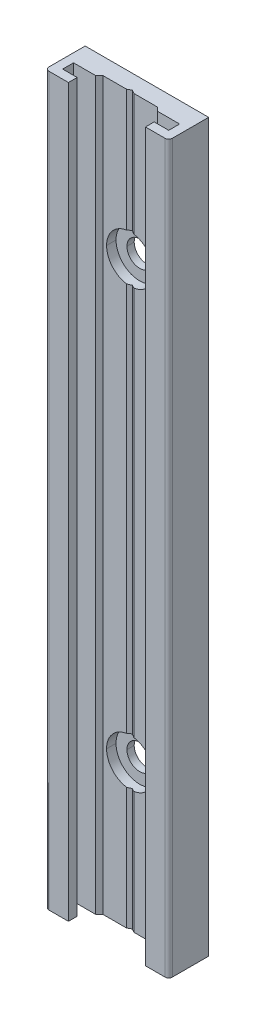
ISO-10303-21;
HEADER;
FILE_DESCRIPTION(('STEP AP214'),'2;1');
FILE_NAME('part.step','',(''),(''),'','','');
FILE_SCHEMA(('AUTOMOTIVE_DESIGN { 1 0 10303 214 1 1 1 1 }'));
ENDSEC;
DATA;
#1=APPLICATION_CONTEXT('core data for automotive mechanical design processes');
#2=APPLICATION_PROTOCOL_DEFINITION('international standard','automotive_design',2000,#1);
#3=PRODUCT_CONTEXT('',#1,'mechanical');
#4=PRODUCT('Part','Part','',(#3));
#5=PRODUCT_RELATED_PRODUCT_CATEGORY('part','',(#4));
#6=PRODUCT_DEFINITION_FORMATION('','',#4);
#7=PRODUCT_DEFINITION_CONTEXT('part definition',#1,'design');
#8=PRODUCT_DEFINITION('design','',#6,#7);
#9=PRODUCT_DEFINITION_SHAPE('','',#8);
#10=(LENGTH_UNIT() NAMED_UNIT(*) SI_UNIT(.MILLI.,.METRE.));
#11=(NAMED_UNIT(*) PLANE_ANGLE_UNIT() SI_UNIT($,.RADIAN.));
#12=(NAMED_UNIT(*) SI_UNIT($,.STERADIAN.) SOLID_ANGLE_UNIT());
#13=UNCERTAINTY_MEASURE_WITH_UNIT(LENGTH_MEASURE(1.E-05),#10,'distance_accuracy_value','');
#14=(GEOMETRIC_REPRESENTATION_CONTEXT(3) GLOBAL_UNCERTAINTY_ASSIGNED_CONTEXT((#13)) GLOBAL_UNIT_ASSIGNED_CONTEXT((#10,
#11,#12)) REPRESENTATION_CONTEXT('',''));
#15=CARTESIAN_POINT('',(0.,0.,0.));
#16=DIRECTION('',(0.,0.,1.));
#17=DIRECTION('',(1.,0.,0.));
#18=AXIS2_PLACEMENT_3D('',#15,#16,#17);
#19=CARTESIAN_POINT('',(5.3,0.,5.5));
#20=DIRECTION('',(-1.,0.,0.));
#21=DIRECTION('',(0.,0.,1.));
#22=AXIS2_PLACEMENT_3D('',#19,#20,#21);
#23=PLANE('',#22);
#24=DIRECTION('',(0.,0.,1.));
#25=VECTOR('',#24,1.);
#26=CARTESIAN_POINT('',(5.3,0.,5.5));
#27=LINE('',#26,#25);
#28=CARTESIAN_POINT('',(5.3,0.,4.3));
#29=VERTEX_POINT('',#28);
#30=CARTESIAN_POINT('',(5.3,0.,5.5));
#31=VERTEX_POINT('',#30);
#32=EDGE_CURVE('E310',#29,#31,#27,.T.);
#33=ORIENTED_EDGE('',*,*,#32,.T.);
#34=DIRECTION('',(0.,1.,0.));
#35=VECTOR('',#34,1.);
#36=CARTESIAN_POINT('',(5.3,0.,5.5));
#37=LINE('',#36,#35);
#38=CARTESIAN_POINT('',(5.3,100.,5.5));
#39=VERTEX_POINT('',#38);
#40=EDGE_CURVE('E236',#39,#31,#37,.F.);
#41=ORIENTED_EDGE('',*,*,#40,.F.);
#42=DIRECTION('',(0.,0.,1.));
#43=VECTOR('',#42,1.);
#44=CARTESIAN_POINT('',(5.3,100.,5.5));
#45=LINE('',#44,#43);
#46=CARTESIAN_POINT('',(5.3,100.,4.3));
#47=VERTEX_POINT('',#46);
#48=EDGE_CURVE('E311',#39,#47,#45,.F.);
#49=ORIENTED_EDGE('',*,*,#48,.T.);
#50=DIRECTION('',(0.,1.,0.));
#51=VECTOR('',#50,1.);
#52=CARTESIAN_POINT('',(5.3,0.,4.3));
#53=LINE('',#52,#51);
#54=EDGE_CURVE('E339',#29,#47,#53,.T.);
#55=ORIENTED_EDGE('',*,*,#54,.F.);
#56=EDGE_LOOP('',(#33,#41,#49,#55));
#57=FACE_BOUND('',#56,.T.);
#58=ADVANCED_FACE('F15',(#57),#23,.T.);
#59=CARTESIAN_POINT('',(7.3,0.,4.3));
#60=DIRECTION('',(-1.,0.,0.));
#61=DIRECTION('',(0.,0.,1.));
#62=AXIS2_PLACEMENT_3D('',#59,#60,#61);
#63=PLANE('',#62);
#64=DIRECTION('',(0.,0.,1.));
#65=VECTOR('',#64,1.);
#66=CARTESIAN_POINT('',(7.3,0.,4.3));
#67=LINE('',#66,#65);
#68=CARTESIAN_POINT('',(7.3,0.,2.8));
#69=VERTEX_POINT('',#68);
#70=CARTESIAN_POINT('',(7.3,0.,4.3));
#71=VERTEX_POINT('',#70);
#72=EDGE_CURVE('E294',#69,#71,#67,.T.);
#73=ORIENTED_EDGE('',*,*,#72,.T.);
#74=DIRECTION('',(0.,1.,0.));
#75=VECTOR('',#74,1.);
#76=CARTESIAN_POINT('',(7.3,0.,4.3));
#77=LINE('',#76,#75);
#78=CARTESIAN_POINT('',(7.3,100.,4.3));
#79=VERTEX_POINT('',#78);
#80=EDGE_CURVE('E343',#79,#71,#77,.F.);
#81=ORIENTED_EDGE('',*,*,#80,.F.);
#82=DIRECTION('',(0.,0.,1.));
#83=VECTOR('',#82,1.);
#84=CARTESIAN_POINT('',(7.3,100.,4.3));
#85=LINE('',#84,#83);
#86=CARTESIAN_POINT('',(7.3,100.,2.8));
#87=VERTEX_POINT('',#86);
#88=EDGE_CURVE('E307',#79,#87,#85,.F.);
#89=ORIENTED_EDGE('',*,*,#88,.T.);
#90=DIRECTION('',(0.,1.,0.));
#91=VECTOR('',#90,1.);
#92=CARTESIAN_POINT('',(7.3,0.,2.8));
#93=LINE('',#92,#91);
#94=EDGE_CURVE('E229',#69,#87,#93,.T.);
#95=ORIENTED_EDGE('',*,*,#94,.F.);
#96=EDGE_LOOP('',(#73,#81,#89,#95));
#97=FACE_BOUND('',#96,.T.);
#98=ADVANCED_FACE('F751',(#97),#63,.T.);
#99=CARTESIAN_POINT('',(0.5,0.,2.3));
#100=DIRECTION('',(-0.499999994031163,0.,0.866025407230548));
#101=DIRECTION('',(0.866025407230548,0.,0.499999994031163));
#102=AXIS2_PLACEMENT_3D('',#99,#100,#101);
#103=PLANE('',#102);
#104=CARTESIAN_POINT('',(0.,20.,2.01132487));
#105=DIRECTION('',(-0.499999994031163,0.,0.866025407230548));
#106=DIRECTION('',(-0.866025407230548,0.,-0.499999994031163));
#107=AXIS2_PLACEMENT_3D('',#104,#105,#106);
#108=ELLIPSE('',#107,3.75277673479943,3.25);
#109=CARTESIAN_POINT('',(0.,23.25,2.01132487));
#110=VERTEX_POINT('',#109);
#111=CARTESIAN_POINT('',(0.5,23.2113081446663,2.3));
#112=VERTEX_POINT('',#111);
#113=EDGE_CURVE('E217',#110,#112,#108,.F.);
#114=ORIENTED_EDGE('',*,*,#113,.T.);
#115=DIRECTION('',(0.,1.,0.));
#116=VECTOR('',#115,1.);
#117=CARTESIAN_POINT('',(0.5,0.,2.3));
#118=LINE('',#117,#116);
#119=CARTESIAN_POINT('',(0.5,76.7886918553337,2.3));
#120=VERTEX_POINT('',#119);
#121=EDGE_CURVE('E215',#120,#112,#118,.F.);
#122=ORIENTED_EDGE('',*,*,#121,.F.);
#123=CARTESIAN_POINT('',(0.,80.,2.01132487));
#124=DIRECTION('',(-0.499999994031163,0.,0.866025407230548));
#125=DIRECTION('',(-0.866025407230548,0.,-0.499999994031163));
#126=AXIS2_PLACEMENT_3D('',#123,#124,#125);
#127=ELLIPSE('',#126,3.75277673479943,3.25);
#128=CARTESIAN_POINT('',(0.,76.75,2.01132487));
#129=VERTEX_POINT('',#128);
#130=EDGE_CURVE('E18',#120,#129,#127,.F.);
#131=ORIENTED_EDGE('',*,*,#130,.T.);
#132=DIRECTION('',(0.,1.,0.));
#133=VECTOR('',#132,1.);
#134=CARTESIAN_POINT('',(0.,0.,2.01132487));
#135=LINE('',#134,#133);
#136=EDGE_CURVE('E251',#110,#129,#135,.T.);
#137=ORIENTED_EDGE('',*,*,#136,.F.);
#138=EDGE_LOOP('',(#114,#122,#131,#137));
#139=FACE_BOUND('',#138,.T.);
#140=ADVANCED_FACE('F216',(#139),#103,.T.);
#141=CARTESIAN_POINT('',(0.5,0.,2.3));
#142=DIRECTION('',(-0.499999994031163,0.,0.866025407230548));
#143=DIRECTION('',(0.866025407230548,0.,0.499999994031163));
#144=AXIS2_PLACEMENT_3D('',#141,#142,#143);
#145=PLANE('',#144);
#146=DIRECTION('',(0.866025407230548,0.,0.499999994031163));
#147=VECTOR('',#146,1.);
#148=CARTESIAN_POINT('',(0.5,0.,2.3));
#149=LINE('',#148,#147);
#150=CARTESIAN_POINT('',(0.,0.,2.01132487));
#151=VERTEX_POINT('',#150);
#152=CARTESIAN_POINT('',(0.5,0.,2.3));
#153=VERTEX_POINT('',#152);
#154=EDGE_CURVE('E292',#151,#153,#149,.T.);
#155=ORIENTED_EDGE('',*,*,#154,.T.);
#156=DIRECTION('',(0.,1.,0.));
#157=VECTOR('',#156,1.);
#158=CARTESIAN_POINT('',(0.5,0.,2.3));
#159=LINE('',#158,#157);
#160=CARTESIAN_POINT('',(0.5,16.7886918553337,2.3));
#161=VERTEX_POINT('',#160);
#162=EDGE_CURVE('E410',#161,#153,#159,.F.);
#163=ORIENTED_EDGE('',*,*,#162,.F.);
#164=CARTESIAN_POINT('',(0.,20.,2.01132487));
#165=DIRECTION('',(-0.499999994031163,0.,0.866025407230548));
#166=DIRECTION('',(-0.866025407230548,0.,-0.499999994031163));
#167=AXIS2_PLACEMENT_3D('',#164,#165,#166);
#168=ELLIPSE('',#167,3.75277673479943,3.25);
#169=CARTESIAN_POINT('',(0.,16.75,2.01132487));
#170=VERTEX_POINT('',#169);
#171=EDGE_CURVE('E258',#161,#170,#168,.F.);
#172=ORIENTED_EDGE('',*,*,#171,.T.);
#173=DIRECTION('',(0.,1.,0.));
#174=VECTOR('',#173,1.);
#175=CARTESIAN_POINT('',(0.,0.,2.01132487));
#176=LINE('',#175,#174);
#177=EDGE_CURVE('E260',#151,#170,#176,.T.);
#178=ORIENTED_EDGE('',*,*,#177,.F.);
#179=EDGE_LOOP('',(#155,#163,#172,#178));
#180=FACE_BOUND('',#179,.T.);
#181=ADVANCED_FACE('F428',(#180),#145,.T.);
#182=CARTESIAN_POINT('',(4.25,0.,2.8));
#183=DIRECTION('',(-0.707106781186548,0.,0.707106781186548));
#184=DIRECTION('',(0.707106781186548,0.,0.707106781186548));
#185=AXIS2_PLACEMENT_3D('',#182,#183,#184);
#186=PLANE('',#185);
#187=DIRECTION('',(0.707106781186548,0.,0.707106781186548));
#188=VECTOR('',#187,1.);
#189=CARTESIAN_POINT('',(4.25,0.,2.8));
#190=LINE('',#189,#188);
#191=CARTESIAN_POINT('',(3.75,0.,2.3));
#192=VERTEX_POINT('',#191);
#193=CARTESIAN_POINT('',(4.25,0.,2.8));
#194=VERTEX_POINT('',#193);
#195=EDGE_CURVE('E278',#192,#194,#190,.T.);
#196=ORIENTED_EDGE('',*,*,#195,.T.);
#197=DIRECTION('',(0.,1.,0.));
#198=VECTOR('',#197,1.);
#199=CARTESIAN_POINT('',(4.25,0.,2.8));
#200=LINE('',#199,#198);
#201=CARTESIAN_POINT('',(4.25,100.,2.8));
#202=VERTEX_POINT('',#201);
#203=EDGE_CURVE('E342',#202,#194,#200,.F.);
#204=ORIENTED_EDGE('',*,*,#203,.F.);
#205=DIRECTION('',(0.707106781186548,0.,0.707106781186548));
#206=VECTOR('',#205,1.);
#207=CARTESIAN_POINT('',(4.25,100.,2.8));
#208=LINE('',#207,#206);
#209=CARTESIAN_POINT('',(3.75,100.,2.3));
#210=VERTEX_POINT('',#209);
#211=EDGE_CURVE('E289',#202,#210,#208,.F.);
#212=ORIENTED_EDGE('',*,*,#211,.T.);
#213=DIRECTION('',(0.,1.,0.));
#214=VECTOR('',#213,1.);
#215=CARTESIAN_POINT('',(3.75,0.,2.3));
#216=LINE('',#215,#214);
#217=EDGE_CURVE('E413',#192,#210,#216,.T.);
#218=ORIENTED_EDGE('',*,*,#217,.F.);
#219=EDGE_LOOP('',(#196,#204,#212,#218));
#220=FACE_BOUND('',#219,.T.);
#221=ADVANCED_FACE('F442',(#220),#186,.T.);
#222=CARTESIAN_POINT('',(0.5,0.,2.3));
#223=DIRECTION('',(-0.499999994031163,0.,0.866025407230548));
#224=DIRECTION('',(0.866025407230548,0.,0.499999994031163));
#225=AXIS2_PLACEMENT_3D('',#222,#223,#224);
#226=PLANE('',#225);
#227=DIRECTION('',(0.866025407230548,0.,0.499999994031163));
#228=VECTOR('',#227,1.);
#229=CARTESIAN_POINT('',(0.5,100.,2.3));
#230=LINE('',#229,#228);
#231=CARTESIAN_POINT('',(0.5,100.,2.3));
#232=VERTEX_POINT('',#231);
#233=CARTESIAN_POINT('',(0.,100.,2.01132487));
#234=VERTEX_POINT('',#233);
#235=EDGE_CURVE('E213',#232,#234,#230,.F.);
#236=ORIENTED_EDGE('',*,*,#235,.T.);
#237=DIRECTION('',(0.,1.,0.));
#238=VECTOR('',#237,1.);
#239=CARTESIAN_POINT('',(0.,0.,2.01132487));
#240=LINE('',#239,#238);
#241=CARTESIAN_POINT('',(0.,83.25,2.01132487));
#242=VERTEX_POINT('',#241);
#243=EDGE_CURVE('E263',#242,#234,#240,.T.);
#244=ORIENTED_EDGE('',*,*,#243,.F.);
#245=CARTESIAN_POINT('',(0.,80.,2.01132487));
#246=DIRECTION('',(-0.499999994031163,0.,0.866025407230548));
#247=DIRECTION('',(-0.866025407230548,0.,-0.499999994031163));
#248=AXIS2_PLACEMENT_3D('',#245,#246,#247);
#249=ELLIPSE('',#248,3.75277673479943,3.25);
#250=CARTESIAN_POINT('',(0.5,83.2113081446663,2.3));
#251=VERTEX_POINT('',#250);
#252=EDGE_CURVE('E265',#242,#251,#249,.F.);
#253=ORIENTED_EDGE('',*,*,#252,.T.);
#254=DIRECTION('',(0.,1.,0.));
#255=VECTOR('',#254,1.);
#256=CARTESIAN_POINT('',(0.5,0.,2.3));
#257=LINE('',#256,#255);
#258=EDGE_CURVE('E407',#232,#251,#257,.F.);
#259=ORIENTED_EDGE('',*,*,#258,.F.);
#260=EDGE_LOOP('',(#236,#244,#253,#259));
#261=FACE_BOUND('',#260,.T.);
#262=ADVANCED_FACE('F766',(#261),#226,.T.);
#263=CARTESIAN_POINT('',(0.,80.,1.65));
#264=DIRECTION('',(0.,0.,-1.));
#265=DIRECTION('',(-1.,0.,0.));
#266=AXIS2_PLACEMENT_3D('',#263,#264,#265);
#267=CYLINDRICAL_SURFACE('',#266,3.25);
#268=CARTESIAN_POINT('',(0.,80.,1.));
#269=DIRECTION('',(0.,0.,-1.));
#270=DIRECTION('',(-1.,0.,0.));
#271=AXIS2_PLACEMENT_3D('',#268,#269,#270);
#272=CIRCLE('',#271,3.25);
#273=CARTESIAN_POINT('',(3.25,80.,1.));
#274=VERTEX_POINT('',#273);
#275=CARTESIAN_POINT('',(-3.25,80.,1.));
#276=VERTEX_POINT('',#275);
#277=EDGE_CURVE('E245',#274,#276,#272,.T.);
#278=ORIENTED_EDGE('',*,*,#277,.T.);
#279=DIRECTION('',(0.,0.,-1.));
#280=VECTOR('',#279,1.);
#281=CARTESIAN_POINT('',(-3.25,80.,1.65));
#282=LINE('',#281,#280);
#283=CARTESIAN_POINT('',(-3.25,80.,2.3));
#284=VERTEX_POINT('',#283);
#285=EDGE_CURVE('E212',#276,#284,#282,.F.);
#286=ORIENTED_EDGE('',*,*,#285,.T.);
#287=CARTESIAN_POINT('',(0.,80.,2.3));
#288=DIRECTION('',(0.,0.,-1.));
#289=DIRECTION('',(-1.,0.,0.));
#290=AXIS2_PLACEMENT_3D('',#287,#288,#289);
#291=CIRCLE('',#290,3.25);
#292=CARTESIAN_POINT('',(-0.5,76.7886918553337,2.3));
#293=VERTEX_POINT('',#292);
#294=EDGE_CURVE('E405',#293,#284,#291,.T.);
#295=ORIENTED_EDGE('',*,*,#294,.F.);
#296=CARTESIAN_POINT('',(0.,80.,2.01132487));
#297=DIRECTION('',(0.499999994031163,0.,0.866025407230548));
#298=DIRECTION('',(0.866025407230548,0.,-0.499999994031163));
#299=AXIS2_PLACEMENT_3D('',#296,#297,#298);
#300=ELLIPSE('',#299,3.75277673479943,3.25);
#301=EDGE_CURVE('E208',#129,#293,#300,.F.);
#302=ORIENTED_EDGE('',*,*,#301,.F.);
#303=ORIENTED_EDGE('',*,*,#130,.F.);
#304=CARTESIAN_POINT('',(0.,80.,2.3));
#305=DIRECTION('',(0.,0.,-1.));
#306=DIRECTION('',(-1.,0.,0.));
#307=AXIS2_PLACEMENT_3D('',#304,#305,#306);
#308=CIRCLE('',#307,3.25);
#309=CARTESIAN_POINT('',(3.25,80.,2.3));
#310=VERTEX_POINT('',#309);
#311=EDGE_CURVE('E205',#310,#120,#308,.T.);
#312=ORIENTED_EDGE('',*,*,#311,.F.);
#313=DIRECTION('',(0.,0.,-1.));
#314=VECTOR('',#313,1.);
#315=CARTESIAN_POINT('',(3.25,80.,1.65));
#316=LINE('',#315,#314);
#317=EDGE_CURVE('E264',#310,#274,#316,.T.);
#318=ORIENTED_EDGE('',*,*,#317,.T.);
#319=EDGE_LOOP('',(#278,#286,#295,#302,#303,#312,#318));
#320=FACE_BOUND('',#319,.T.);
#321=ADVANCED_FACE('F203',(#320),#267,.F.);
#322=CARTESIAN_POINT('',(0.,80.,1.65));
#323=DIRECTION('',(0.,0.,-1.));
#324=DIRECTION('',(-1.,0.,0.));
#325=AXIS2_PLACEMENT_3D('',#322,#323,#324);
#326=CYLINDRICAL_SURFACE('',#325,3.25);
#327=CARTESIAN_POINT('',(0.,80.,2.3));
#328=DIRECTION('',(0.,0.,-1.));
#329=DIRECTION('',(-1.,0.,0.));
#330=AXIS2_PLACEMENT_3D('',#327,#328,#329);
#331=CIRCLE('',#330,3.25);
#332=EDGE_CURVE('E227',#251,#310,#331,.T.);
#333=ORIENTED_EDGE('',*,*,#332,.F.);
#334=ORIENTED_EDGE('',*,*,#252,.F.);
#335=CARTESIAN_POINT('',(0.,80.,2.01132487));
#336=DIRECTION('',(0.499999994031163,0.,0.866025407230548));
#337=DIRECTION('',(0.866025407230548,0.,-0.499999994031163));
#338=AXIS2_PLACEMENT_3D('',#335,#336,#337);
#339=ELLIPSE('',#338,3.75277673479943,3.25);
#340=CARTESIAN_POINT('',(-0.5,83.2113081446663,2.3));
#341=VERTEX_POINT('',#340);
#342=EDGE_CURVE('E261',#341,#242,#339,.F.);
#343=ORIENTED_EDGE('',*,*,#342,.F.);
#344=CARTESIAN_POINT('',(0.,80.,2.3));
#345=DIRECTION('',(0.,0.,-1.));
#346=DIRECTION('',(-1.,0.,0.));
#347=AXIS2_PLACEMENT_3D('',#344,#345,#346);
#348=CIRCLE('',#347,3.25);
#349=EDGE_CURVE('E401',#284,#341,#348,.T.);
#350=ORIENTED_EDGE('',*,*,#349,.F.);
#351=ORIENTED_EDGE('',*,*,#285,.F.);
#352=CARTESIAN_POINT('',(0.,80.,1.));
#353=DIRECTION('',(0.,0.,-1.));
#354=DIRECTION('',(-1.,0.,0.));
#355=AXIS2_PLACEMENT_3D('',#352,#353,#354);
#356=CIRCLE('',#355,3.25);
#357=EDGE_CURVE('E242',#276,#274,#356,.T.);
#358=ORIENTED_EDGE('',*,*,#357,.T.);
#359=ORIENTED_EDGE('',*,*,#317,.F.);
#360=EDGE_LOOP('',(#333,#334,#343,#350,#351,#358,#359));
#361=FACE_BOUND('',#360,.T.);
#362=ADVANCED_FACE('F769',(#361),#326,.F.);
#363=CARTESIAN_POINT('',(0.,0.,2.01132487));
#364=DIRECTION('',(0.499999994031163,0.,0.866025407230548));
#365=DIRECTION('',(0.866025407230548,0.,-0.499999994031163));
#366=AXIS2_PLACEMENT_3D('',#363,#364,#365);
#367=PLANE('',#366);
#368=DIRECTION('',(0.866025407230548,0.,-0.499999994031163));
#369=VECTOR('',#368,1.);
#370=CARTESIAN_POINT('',(0.,100.,2.01132487));
#371=LINE('',#370,#369);
#372=CARTESIAN_POINT('',(-0.5,100.,2.3));
#373=VERTEX_POINT('',#372);
#374=EDGE_CURVE('E504',#234,#373,#371,.F.);
#375=ORIENTED_EDGE('',*,*,#374,.T.);
#376=DIRECTION('',(0.,1.,0.));
#377=VECTOR('',#376,1.);
#378=CARTESIAN_POINT('',(-0.5,0.,2.3));
#379=LINE('',#378,#377);
#380=EDGE_CURVE('E404',#341,#373,#379,.T.);
#381=ORIENTED_EDGE('',*,*,#380,.F.);
#382=ORIENTED_EDGE('',*,*,#342,.T.);
#383=ORIENTED_EDGE('',*,*,#243,.T.);
#384=EDGE_LOOP('',(#375,#381,#382,#383));
#385=FACE_BOUND('',#384,.T.);
#386=ADVANCED_FACE('F767',(#385),#367,.T.);
#387=CARTESIAN_POINT('',(0.,0.,2.01132487));
#388=DIRECTION('',(0.499999994031163,0.,0.866025407230548));
#389=DIRECTION('',(0.866025407230548,0.,-0.499999994031163));
#390=AXIS2_PLACEMENT_3D('',#387,#388,#389);
#391=PLANE('',#390);
#392=DIRECTION('',(0.866025407230548,0.,-0.499999994031163));
#393=VECTOR('',#392,1.);
#394=CARTESIAN_POINT('',(0.,0.,2.01132487));
#395=LINE('',#394,#393);
#396=CARTESIAN_POINT('',(-0.5,0.,2.3));
#397=VERTEX_POINT('',#396);
#398=EDGE_CURVE('E499',#397,#151,#395,.T.);
#399=ORIENTED_EDGE('',*,*,#398,.T.);
#400=ORIENTED_EDGE('',*,*,#177,.T.);
#401=CARTESIAN_POINT('',(0.,20.,2.01132487));
#402=DIRECTION('',(0.499999994031163,0.,0.866025407230548));
#403=DIRECTION('',(0.866025407230548,0.,-0.499999994031163));
#404=AXIS2_PLACEMENT_3D('',#401,#402,#403);
#405=ELLIPSE('',#404,3.75277673479943,3.25);
#406=CARTESIAN_POINT('',(-0.5,16.7886918553337,2.3));
#407=VERTEX_POINT('',#406);
#408=EDGE_CURVE('E256',#170,#407,#405,.F.);
#409=ORIENTED_EDGE('',*,*,#408,.T.);
#410=DIRECTION('',(0.,1.,0.));
#411=VECTOR('',#410,1.);
#412=CARTESIAN_POINT('',(-0.5,0.,2.3));
#413=LINE('',#412,#411);
#414=EDGE_CURVE('E400',#397,#407,#413,.T.);
#415=ORIENTED_EDGE('',*,*,#414,.F.);
#416=EDGE_LOOP('',(#399,#400,#409,#415));
#417=FACE_BOUND('',#416,.T.);
#418=ADVANCED_FACE('F608',(#417),#391,.T.);
#419=CARTESIAN_POINT('',(0.,20.,1.65));
#420=DIRECTION('',(0.,0.,-1.));
#421=DIRECTION('',(-1.,0.,0.));
#422=AXIS2_PLACEMENT_3D('',#419,#420,#421);
#423=CYLINDRICAL_SURFACE('',#422,3.25);
#424=CARTESIAN_POINT('',(0.,20.,1.));
#425=DIRECTION('',(0.,0.,-1.));
#426=DIRECTION('',(-1.,0.,0.));
#427=AXIS2_PLACEMENT_3D('',#424,#425,#426);
#428=CIRCLE('',#427,3.25);
#429=CARTESIAN_POINT('',(3.25,20.,1.));
#430=VERTEX_POINT('',#429);
#431=CARTESIAN_POINT('',(-3.25,20.,1.));
#432=VERTEX_POINT('',#431);
#433=EDGE_CURVE('E240',#430,#432,#428,.T.);
#434=ORIENTED_EDGE('',*,*,#433,.T.);
#435=DIRECTION('',(0.,0.,-1.));
#436=VECTOR('',#435,1.);
#437=CARTESIAN_POINT('',(-3.25,20.,1.65));
#438=LINE('',#437,#436);
#439=CARTESIAN_POINT('',(-3.25,20.,2.3));
#440=VERTEX_POINT('',#439);
#441=EDGE_CURVE('E255',#432,#440,#438,.F.);
#442=ORIENTED_EDGE('',*,*,#441,.T.);
#443=CARTESIAN_POINT('',(0.,20.,2.3));
#444=DIRECTION('',(0.,0.,-1.));
#445=DIRECTION('',(-1.,0.,0.));
#446=AXIS2_PLACEMENT_3D('',#443,#444,#445);
#447=CIRCLE('',#446,3.25);
#448=EDGE_CURVE('E397',#407,#440,#447,.T.);
#449=ORIENTED_EDGE('',*,*,#448,.F.);
#450=ORIENTED_EDGE('',*,*,#408,.F.);
#451=ORIENTED_EDGE('',*,*,#171,.F.);
#452=CARTESIAN_POINT('',(0.,20.,2.3));
#453=DIRECTION('',(0.,0.,-1.));
#454=DIRECTION('',(-1.,0.,0.));
#455=AXIS2_PLACEMENT_3D('',#452,#453,#454);
#456=CIRCLE('',#455,3.25);
#457=CARTESIAN_POINT('',(3.25,20.,2.3));
#458=VERTEX_POINT('',#457);
#459=EDGE_CURVE('E408',#458,#161,#456,.T.);
#460=ORIENTED_EDGE('',*,*,#459,.F.);
#461=DIRECTION('',(0.,0.,-1.));
#462=VECTOR('',#461,1.);
#463=CARTESIAN_POINT('',(3.25,20.,1.65));
#464=LINE('',#463,#462);
#465=EDGE_CURVE('E253',#458,#430,#464,.T.);
#466=ORIENTED_EDGE('',*,*,#465,.T.);
#467=EDGE_LOOP('',(#434,#442,#449,#450,#451,#460,#466));
#468=FACE_BOUND('',#467,.T.);
#469=ADVANCED_FACE('F421',(#468),#423,.F.);
#470=CARTESIAN_POINT('',(0.,20.,1.65));
#471=DIRECTION('',(0.,0.,-1.));
#472=DIRECTION('',(-1.,0.,0.));
#473=AXIS2_PLACEMENT_3D('',#470,#471,#472);
#474=CYLINDRICAL_SURFACE('',#473,3.25);
#475=CARTESIAN_POINT('',(0.,20.,2.3));
#476=DIRECTION('',(0.,0.,-1.));
#477=DIRECTION('',(-1.,0.,0.));
#478=AXIS2_PLACEMENT_3D('',#475,#476,#477);
#479=CIRCLE('',#478,3.25);
#480=EDGE_CURVE('E221',#112,#458,#479,.T.);
#481=ORIENTED_EDGE('',*,*,#480,.F.);
#482=ORIENTED_EDGE('',*,*,#113,.F.);
#483=CARTESIAN_POINT('',(0.,20.,2.01132487));
#484=DIRECTION('',(0.499999994031163,0.,0.866025407230548));
#485=DIRECTION('',(0.866025407230548,0.,-0.499999994031163));
#486=AXIS2_PLACEMENT_3D('',#483,#484,#485);
#487=ELLIPSE('',#486,3.75277673479943,3.25);
#488=CARTESIAN_POINT('',(-0.5,23.2113081446663,2.3));
#489=VERTEX_POINT('',#488);
#490=EDGE_CURVE('E248',#489,#110,#487,.F.);
#491=ORIENTED_EDGE('',*,*,#490,.F.);
#492=CARTESIAN_POINT('',(0.,20.,2.3));
#493=DIRECTION('',(0.,0.,-1.));
#494=DIRECTION('',(-1.,0.,0.));
#495=AXIS2_PLACEMENT_3D('',#492,#493,#494);
#496=CIRCLE('',#495,3.25);
#497=EDGE_CURVE('E393',#440,#489,#496,.T.);
#498=ORIENTED_EDGE('',*,*,#497,.F.);
#499=ORIENTED_EDGE('',*,*,#441,.F.);
#500=CARTESIAN_POINT('',(0.,20.,1.));
#501=DIRECTION('',(0.,0.,-1.));
#502=DIRECTION('',(-1.,0.,0.));
#503=AXIS2_PLACEMENT_3D('',#500,#501,#502);
#504=CIRCLE('',#503,3.25);
#505=EDGE_CURVE('E237',#432,#430,#504,.T.);
#506=ORIENTED_EDGE('',*,*,#505,.T.);
#507=ORIENTED_EDGE('',*,*,#465,.F.);
#508=EDGE_LOOP('',(#481,#482,#491,#498,#499,#506,#507));
#509=FACE_BOUND('',#508,.T.);
#510=ADVANCED_FACE('F416',(#509),#474,.F.);
#511=CARTESIAN_POINT('',(0.,0.,2.01132487));
#512=DIRECTION('',(0.499999994031163,0.,0.866025407230548));
#513=DIRECTION('',(0.866025407230548,0.,-0.499999994031163));
#514=AXIS2_PLACEMENT_3D('',#511,#512,#513);
#515=PLANE('',#514);
#516=ORIENTED_EDGE('',*,*,#490,.T.);
#517=ORIENTED_EDGE('',*,*,#136,.T.);
#518=ORIENTED_EDGE('',*,*,#301,.T.);
#519=DIRECTION('',(0.,1.,0.));
#520=VECTOR('',#519,1.);
#521=CARTESIAN_POINT('',(-0.5,0.,2.3));
#522=LINE('',#521,#520);
#523=EDGE_CURVE('E396',#489,#293,#522,.T.);
#524=ORIENTED_EDGE('',*,*,#523,.F.);
#525=EDGE_LOOP('',(#516,#517,#518,#524));
#526=FACE_BOUND('',#525,.T.);
#527=ADVANCED_FACE('F612',(#526),#515,.T.);
#528=CARTESIAN_POINT('',(-3.75,0.,2.3));
#529=DIRECTION('',(0.707106781186548,0.,0.707106781186548));
#530=DIRECTION('',(0.707106781186548,0.,-0.707106781186548));
#531=AXIS2_PLACEMENT_3D('',#528,#529,#530);
#532=PLANE('',#531);
#533=DIRECTION('',(0.707106781186548,0.,-0.707106781186548));
#534=VECTOR('',#533,1.);
#535=CARTESIAN_POINT('',(-3.75,0.,2.3));
#536=LINE('',#535,#534);
#537=CARTESIAN_POINT('',(-4.25,0.,2.8));
#538=VERTEX_POINT('',#537);
#539=CARTESIAN_POINT('',(-3.75,0.,2.3));
#540=VERTEX_POINT('',#539);
#541=EDGE_CURVE('E490',#538,#540,#536,.T.);
#542=ORIENTED_EDGE('',*,*,#541,.T.);
#543=DIRECTION('',(0.,1.,0.));
#544=VECTOR('',#543,1.);
#545=CARTESIAN_POINT('',(-3.75,0.,2.3));
#546=LINE('',#545,#544);
#547=CARTESIAN_POINT('',(-3.75,100.,2.3));
#548=VERTEX_POINT('',#547);
#549=EDGE_CURVE('E580',#548,#540,#546,.F.);
#550=ORIENTED_EDGE('',*,*,#549,.F.);
#551=DIRECTION('',(0.707106781186548,0.,-0.707106781186548));
#552=VECTOR('',#551,1.);
#553=CARTESIAN_POINT('',(-3.75,100.,2.3));
#554=LINE('',#553,#552);
#555=CARTESIAN_POINT('',(-4.25,100.,2.8));
#556=VERTEX_POINT('',#555);
#557=EDGE_CURVE('E493',#548,#556,#554,.F.);
#558=ORIENTED_EDGE('',*,*,#557,.T.);
#559=DIRECTION('',(0.,1.,0.));
#560=VECTOR('',#559,1.);
#561=CARTESIAN_POINT('',(-4.25,0.,2.8));
#562=LINE('',#561,#560);
#563=EDGE_CURVE('E322',#538,#556,#562,.T.);
#564=ORIENTED_EDGE('',*,*,#563,.F.);
#565=EDGE_LOOP('',(#542,#550,#558,#564));
#566=FACE_BOUND('',#565,.T.);
#567=ADVANCED_FACE('F600',(#566),#532,.T.);
#568=CARTESIAN_POINT('',(-7.3,0.,2.8));
#569=DIRECTION('',(1.,0.,0.));
#570=DIRECTION('',(0.,0.,-1.));
#571=AXIS2_PLACEMENT_3D('',#568,#569,#570);
#572=PLANE('',#571);
#573=DIRECTION('',(0.,0.,-1.));
#574=VECTOR('',#573,1.);
#575=CARTESIAN_POINT('',(-7.3,0.,2.8));
#576=LINE('',#575,#574);
#577=CARTESIAN_POINT('',(-7.3,0.,4.3));
#578=VERTEX_POINT('',#577);
#579=CARTESIAN_POINT('',(-7.3,0.,2.8));
#580=VERTEX_POINT('',#579);
#581=EDGE_CURVE('E482',#578,#580,#576,.T.);
#582=ORIENTED_EDGE('',*,*,#581,.T.);
#583=DIRECTION('',(0.,1.,0.));
#584=VECTOR('',#583,1.);
#585=CARTESIAN_POINT('',(-7.3,0.,2.8));
#586=LINE('',#585,#584);
#587=CARTESIAN_POINT('',(-7.3,100.,2.8));
#588=VERTEX_POINT('',#587);
#589=EDGE_CURVE('E574',#588,#580,#586,.F.);
#590=ORIENTED_EDGE('',*,*,#589,.F.);
#591=DIRECTION('',(0.,0.,-1.));
#592=VECTOR('',#591,1.);
#593=CARTESIAN_POINT('',(-7.3,100.,2.8));
#594=LINE('',#593,#592);
#595=CARTESIAN_POINT('',(-7.3,100.,4.3));
#596=VERTEX_POINT('',#595);
#597=EDGE_CURVE('E487',#588,#596,#594,.F.);
#598=ORIENTED_EDGE('',*,*,#597,.T.);
#599=DIRECTION('',(0.,1.,0.));
#600=VECTOR('',#599,1.);
#601=CARTESIAN_POINT('',(-7.3,0.,4.3));
#602=LINE('',#601,#600);
#603=EDGE_CURVE('E321',#578,#596,#602,.T.);
#604=ORIENTED_EDGE('',*,*,#603,.F.);
#605=EDGE_LOOP('',(#582,#590,#598,#604));
#606=FACE_BOUND('',#605,.T.);
#607=ADVANCED_FACE('F620',(#606),#572,.T.);
#608=CARTESIAN_POINT('',(-5.3,0.,4.3));
#609=DIRECTION('',(1.,0.,0.));
#610=DIRECTION('',(0.,0.,-1.));
#611=AXIS2_PLACEMENT_3D('',#608,#609,#610);
#612=PLANE('',#611);
#613=DIRECTION('',(0.,0.,-1.));
#614=VECTOR('',#613,1.);
#615=CARTESIAN_POINT('',(-5.3,0.,4.3));
#616=LINE('',#615,#614);
#617=CARTESIAN_POINT('',(-5.3,0.,5.5));
#618=VERTEX_POINT('',#617);
#619=CARTESIAN_POINT('',(-5.3,0.,4.3));
#620=VERTEX_POINT('',#619);
#621=EDGE_CURVE('E247',#618,#620,#616,.T.);
#622=ORIENTED_EDGE('',*,*,#621,.T.);
#623=DIRECTION('',(0.,1.,0.));
#624=VECTOR('',#623,1.);
#625=CARTESIAN_POINT('',(-5.3,0.,4.3));
#626=LINE('',#625,#624);
#627=CARTESIAN_POINT('',(-5.3,100.,4.3));
#628=VERTEX_POINT('',#627);
#629=EDGE_CURVE('E318',#628,#620,#626,.F.);
#630=ORIENTED_EDGE('',*,*,#629,.F.);
#631=DIRECTION('',(0.,0.,-1.));
#632=VECTOR('',#631,1.);
#633=CARTESIAN_POINT('',(-5.3,100.,4.3));
#634=LINE('',#633,#632);
#635=CARTESIAN_POINT('',(-5.3,100.,5.5));
#636=VERTEX_POINT('',#635);
#637=EDGE_CURVE('E478',#628,#636,#634,.F.);
#638=ORIENTED_EDGE('',*,*,#637,.T.);
#639=DIRECTION('',(0.,1.,0.));
#640=VECTOR('',#639,1.);
#641=CARTESIAN_POINT('',(-5.3,0.,5.5));
#642=LINE('',#641,#640);
#643=EDGE_CURVE('E566',#618,#636,#642,.T.);
#644=ORIENTED_EDGE('',*,*,#643,.F.);
#645=EDGE_LOOP('',(#622,#630,#638,#644));
#646=FACE_BOUND('',#645,.T.);
#647=ADVANCED_FACE('F701',(#646),#612,.T.);
#648=CARTESIAN_POINT('',(2.5,80.,1.));
#649=DIRECTION('',(0.,0.,-1.));
#650=DIRECTION('',(-1.,0.,0.));
#651=AXIS2_PLACEMENT_3D('',#648,#649,#650);
#652=PLANE('',#651);
#653=CARTESIAN_POINT('',(0.,80.,1.));
#654=DIRECTION('',(0.,0.,-1.));
#655=DIRECTION('',(-1.,0.,0.));
#656=AXIS2_PLACEMENT_3D('',#653,#654,#655);
#657=CIRCLE('',#656,1.75);
#658=CARTESIAN_POINT('',(1.75,80.,1.));
#659=VERTEX_POINT('',#658);
#660=CARTESIAN_POINT('',(-1.75,80.,1.));
#661=VERTEX_POINT('',#660);
#662=EDGE_CURVE('E387',#659,#661,#657,.T.);
#663=ORIENTED_EDGE('',*,*,#662,.T.);
#664=CARTESIAN_POINT('',(0.,80.,1.));
#665=DIRECTION('',(0.,0.,-1.));
#666=DIRECTION('',(-1.,0.,0.));
#667=AXIS2_PLACEMENT_3D('',#664,#665,#666);
#668=CIRCLE('',#667,1.75);
#669=EDGE_CURVE('E390',#661,#659,#668,.T.);
#670=ORIENTED_EDGE('',*,*,#669,.T.);
#671=EDGE_LOOP('',(#663,#670));
#672=FACE_BOUND('',#671,.T.);
#673=ORIENTED_EDGE('',*,*,#277,.F.);
#674=ORIENTED_EDGE('',*,*,#357,.F.);
#675=EDGE_LOOP('',(#673,#674));
#676=FACE_BOUND('',#675,.T.);
#677=ADVANCED_FACE('F697',(#672,#676),#652,.F.);
#678=CARTESIAN_POINT('',(2.5,20.,1.));
#679=DIRECTION('',(0.,0.,-1.));
#680=DIRECTION('',(-1.,0.,0.));
#681=AXIS2_PLACEMENT_3D('',#678,#679,#680);
#682=PLANE('',#681);
#683=CARTESIAN_POINT('',(0.,20.,1.));
#684=DIRECTION('',(0.,0.,-1.));
#685=DIRECTION('',(-1.,0.,0.));
#686=AXIS2_PLACEMENT_3D('',#683,#684,#685);
#687=CIRCLE('',#686,1.75);
#688=CARTESIAN_POINT('',(1.75,20.,1.));
#689=VERTEX_POINT('',#688);
#690=CARTESIAN_POINT('',(-1.75,20.,1.));
#691=VERTEX_POINT('',#690);
#692=EDGE_CURVE('E381',#689,#691,#687,.T.);
#693=ORIENTED_EDGE('',*,*,#692,.T.);
#694=CARTESIAN_POINT('',(0.,20.,1.));
#695=DIRECTION('',(0.,0.,-1.));
#696=DIRECTION('',(-1.,0.,0.));
#697=AXIS2_PLACEMENT_3D('',#694,#695,#696);
#698=CIRCLE('',#697,1.75);
#699=EDGE_CURVE('E384',#691,#689,#698,.T.);
#700=ORIENTED_EDGE('',*,*,#699,.T.);
#701=EDGE_LOOP('',(#693,#700));
#702=FACE_BOUND('',#701,.T.);
#703=ORIENTED_EDGE('',*,*,#433,.F.);
#704=ORIENTED_EDGE('',*,*,#505,.F.);
#705=EDGE_LOOP('',(#703,#704));
#706=FACE_BOUND('',#705,.T.);
#707=ADVANCED_FACE('F693',(#702,#706),#682,.F.);
#708=CARTESIAN_POINT('',(7.99999999999999,0.,4.99999999999999));
#709=DIRECTION('',(0.,-1.,0.));
#710=DIRECTION('',(0.,0.,-1.));
#711=AXIS2_PLACEMENT_3D('',#708,#709,#710);
#712=CYLINDRICAL_SURFACE('',#711,0.500000000000007);
#713=CARTESIAN_POINT('',(7.99999999999999,0.,4.99999999999999));
#714=DIRECTION('',(0.,-1.,0.));
#715=DIRECTION('',(0.,0.,-1.));
#716=AXIS2_PLACEMENT_3D('',#713,#714,#715);
#717=CIRCLE('',#716,0.500000000000007);
#718=CARTESIAN_POINT('',(7.99999999999999,0.,5.5));
#719=VERTEX_POINT('',#718);
#720=CARTESIAN_POINT('',(8.5,0.,5.));
#721=VERTEX_POINT('',#720);
#722=EDGE_CURVE('E234',#719,#721,#717,.F.);
#723=ORIENTED_EDGE('',*,*,#722,.T.);
#724=DIRECTION('',(0.,1.,0.));
#725=VECTOR('',#724,1.);
#726=CARTESIAN_POINT('',(8.5,0.,5.));
#727=LINE('',#726,#725);
#728=CARTESIAN_POINT('',(8.5,100.,5.));
#729=VERTEX_POINT('',#728);
#730=EDGE_CURVE('E464',#729,#721,#727,.F.);
#731=ORIENTED_EDGE('',*,*,#730,.F.);
#732=CARTESIAN_POINT('',(7.99999999999999,100.,4.99999999999999));
#733=DIRECTION('',(0.,-1.,0.));
#734=DIRECTION('',(0.,0.,-1.));
#735=AXIS2_PLACEMENT_3D('',#732,#733,#734);
#736=CIRCLE('',#735,0.500000000000007);
#737=CARTESIAN_POINT('',(7.99999999999999,100.,5.5));
#738=VERTEX_POINT('',#737);
#739=EDGE_CURVE('E378',#729,#738,#736,.T.);
#740=ORIENTED_EDGE('',*,*,#739,.T.);
#741=DIRECTION('',(0.,1.,0.));
#742=VECTOR('',#741,1.);
#743=CARTESIAN_POINT('',(8.,0.,5.5));
#744=LINE('',#743,#742);
#745=EDGE_CURVE('E457',#719,#738,#744,.T.);
#746=ORIENTED_EDGE('',*,*,#745,.F.);
#747=EDGE_LOOP('',(#723,#731,#740,#746));
#748=FACE_BOUND('',#747,.T.);
#749=ADVANCED_FACE('F689',(#748),#712,.T.);
#750=CARTESIAN_POINT('',(8.,0.,5.5));
#751=DIRECTION('',(0.,0.,1.));
#752=DIRECTION('',(1.,0.,0.));
#753=AXIS2_PLACEMENT_3D('',#750,#751,#752);
#754=PLANE('',#753);
#755=DIRECTION('',(1.,0.,0.));
#756=VECTOR('',#755,1.);
#757=CARTESIAN_POINT('',(0.,0.,5.5));
#758=LINE('',#757,#756);
#759=EDGE_CURVE('E349',#719,#31,#758,.F.);
#760=ORIENTED_EDGE('',*,*,#759,.F.);
#761=ORIENTED_EDGE('',*,*,#745,.T.);
#762=DIRECTION('',(1.,0.,0.));
#763=VECTOR('',#762,1.);
#764=CARTESIAN_POINT('',(0.,100.,5.5));
#765=LINE('',#764,#763);
#766=EDGE_CURVE('E355',#738,#39,#765,.F.);
#767=ORIENTED_EDGE('',*,*,#766,.T.);
#768=ORIENTED_EDGE('',*,*,#40,.T.);
#769=EDGE_LOOP('',(#760,#761,#767,#768));
#770=FACE_BOUND('',#769,.T.);
#771=ADVANCED_FACE('F685',(#770),#754,.T.);
#772=CARTESIAN_POINT('',(5.3,0.,4.3));
#773=DIRECTION('',(0.,0.,-1.));
#774=DIRECTION('',(-1.,0.,0.));
#775=AXIS2_PLACEMENT_3D('',#772,#773,#774);
#776=PLANE('',#775);
#777=DIRECTION('',(1.,0.,0.));
#778=VECTOR('',#777,1.);
#779=CARTESIAN_POINT('',(0.,0.,4.3));
#780=LINE('',#779,#778);
#781=EDGE_CURVE('E346',#29,#71,#780,.T.);
#782=ORIENTED_EDGE('',*,*,#781,.F.);
#783=ORIENTED_EDGE('',*,*,#54,.T.);
#784=DIRECTION('',(1.,0.,0.));
#785=VECTOR('',#784,1.);
#786=CARTESIAN_POINT('',(0.,100.,4.3));
#787=LINE('',#786,#785);
#788=EDGE_CURVE('E352',#47,#79,#787,.T.);
#789=ORIENTED_EDGE('',*,*,#788,.T.);
#790=ORIENTED_EDGE('',*,*,#80,.T.);
#791=EDGE_LOOP('',(#782,#783,#789,#790));
#792=FACE_BOUND('',#791,.T.);
#793=ADVANCED_FACE('F681',(#792),#776,.T.);
#794=CARTESIAN_POINT('',(7.3,0.,2.8));
#795=DIRECTION('',(0.,0.,1.));
#796=DIRECTION('',(1.,0.,0.));
#797=AXIS2_PLACEMENT_3D('',#794,#795,#796);
#798=PLANE('',#797);
#799=DIRECTION('',(1.,0.,0.));
#800=VECTOR('',#799,1.);
#801=CARTESIAN_POINT('',(0.,0.,2.8));
#802=LINE('',#801,#800);
#803=EDGE_CURVE('E301',#69,#194,#802,.F.);
#804=ORIENTED_EDGE('',*,*,#803,.F.);
#805=ORIENTED_EDGE('',*,*,#94,.T.);
#806=DIRECTION('',(1.,0.,0.));
#807=VECTOR('',#806,1.);
#808=CARTESIAN_POINT('',(0.,100.,2.8));
#809=LINE('',#808,#807);
#810=EDGE_CURVE('E284',#87,#202,#809,.F.);
#811=ORIENTED_EDGE('',*,*,#810,.T.);
#812=ORIENTED_EDGE('',*,*,#203,.T.);
#813=EDGE_LOOP('',(#804,#805,#811,#812));
#814=FACE_BOUND('',#813,.T.);
#815=ADVANCED_FACE('F678',(#814),#798,.T.);
#816=CARTESIAN_POINT('',(3.75,0.,2.3));
#817=DIRECTION('',(0.,0.,1.));
#818=DIRECTION('',(1.,0.,0.));
#819=AXIS2_PLACEMENT_3D('',#816,#817,#818);
#820=PLANE('',#819);
#821=DIRECTION('',(1.,0.,0.));
#822=VECTOR('',#821,1.);
#823=CARTESIAN_POINT('',(0.,100.,2.3));
#824=LINE('',#823,#822);
#825=EDGE_CURVE('E281',#210,#232,#824,.F.);
#826=ORIENTED_EDGE('',*,*,#825,.T.);
#827=ORIENTED_EDGE('',*,*,#258,.T.);
#828=ORIENTED_EDGE('',*,*,#332,.T.);
#829=ORIENTED_EDGE('',*,*,#311,.T.);
#830=ORIENTED_EDGE('',*,*,#121,.T.);
#831=ORIENTED_EDGE('',*,*,#480,.T.);
#832=ORIENTED_EDGE('',*,*,#459,.T.);
#833=ORIENTED_EDGE('',*,*,#162,.T.);
#834=DIRECTION('',(1.,0.,0.));
#835=VECTOR('',#834,1.);
#836=CARTESIAN_POINT('',(0.,0.,2.3));
#837=LINE('',#836,#835);
#838=EDGE_CURVE('E297',#192,#153,#837,.F.);
#839=ORIENTED_EDGE('',*,*,#838,.F.);
#840=ORIENTED_EDGE('',*,*,#217,.T.);
#841=EDGE_LOOP('',(#826,#827,#828,#829,#830,#831,#832,#833,#839,#840));
#842=FACE_BOUND('',#841,.T.);
#843=ADVANCED_FACE('F224',(#842),#820,.T.);
#844=CARTESIAN_POINT('',(-0.5,0.,2.3));
#845=DIRECTION('',(0.,0.,1.));
#846=DIRECTION('',(1.,0.,0.));
#847=AXIS2_PLACEMENT_3D('',#844,#845,#846);
#848=PLANE('',#847);
#849=ORIENTED_EDGE('',*,*,#497,.T.);
#850=ORIENTED_EDGE('',*,*,#523,.T.);
#851=ORIENTED_EDGE('',*,*,#294,.T.);
#852=ORIENTED_EDGE('',*,*,#349,.T.);
#853=ORIENTED_EDGE('',*,*,#380,.T.);
#854=DIRECTION('',(1.,0.,0.));
#855=VECTOR('',#854,1.);
#856=CARTESIAN_POINT('',(0.,100.,2.3));
#857=LINE('',#856,#855);
#858=EDGE_CURVE('E283',#373,#548,#857,.F.);
#859=ORIENTED_EDGE('',*,*,#858,.T.);
#860=ORIENTED_EDGE('',*,*,#549,.T.);
#861=DIRECTION('',(1.,0.,0.));
#862=VECTOR('',#861,1.);
#863=CARTESIAN_POINT('',(0.,0.,2.3));
#864=LINE('',#863,#862);
#865=EDGE_CURVE('E300',#397,#540,#864,.F.);
#866=ORIENTED_EDGE('',*,*,#865,.F.);
#867=ORIENTED_EDGE('',*,*,#414,.T.);
#868=ORIENTED_EDGE('',*,*,#448,.T.);
#869=EDGE_LOOP('',(#849,#850,#851,#852,#853,#859,#860,#866,#867,#868));
#870=FACE_BOUND('',#869,.T.);
#871=ADVANCED_FACE('F587',(#870),#848,.T.);
#872=CARTESIAN_POINT('',(-4.25,0.,2.8));
#873=DIRECTION('',(0.,0.,1.));
#874=DIRECTION('',(1.,0.,0.));
#875=AXIS2_PLACEMENT_3D('',#872,#873,#874);
#876=PLANE('',#875);
#877=DIRECTION('',(1.,0.,0.));
#878=VECTOR('',#877,1.);
#879=CARTESIAN_POINT('',(0.,0.,2.8));
#880=LINE('',#879,#878);
#881=EDGE_CURVE('E329',#538,#580,#880,.F.);
#882=ORIENTED_EDGE('',*,*,#881,.F.);
#883=ORIENTED_EDGE('',*,*,#563,.T.);
#884=DIRECTION('',(1.,0.,0.));
#885=VECTOR('',#884,1.);
#886=CARTESIAN_POINT('',(0.,100.,2.8));
#887=LINE('',#886,#885);
#888=EDGE_CURVE('E336',#556,#588,#887,.F.);
#889=ORIENTED_EDGE('',*,*,#888,.T.);
#890=ORIENTED_EDGE('',*,*,#589,.T.);
#891=EDGE_LOOP('',(#882,#883,#889,#890));
#892=FACE_BOUND('',#891,.T.);
#893=ADVANCED_FACE('F670',(#892),#876,.T.);
#894=CARTESIAN_POINT('',(-7.3,0.,4.3));
#895=DIRECTION('',(0.,0.,-1.));
#896=DIRECTION('',(-1.,0.,0.));
#897=AXIS2_PLACEMENT_3D('',#894,#895,#896);
#898=PLANE('',#897);
#899=DIRECTION('',(1.,0.,0.));
#900=VECTOR('',#899,1.);
#901=CARTESIAN_POINT('',(0.,0.,4.3));
#902=LINE('',#901,#900);
#903=EDGE_CURVE('E325',#578,#620,#902,.T.);
#904=ORIENTED_EDGE('',*,*,#903,.F.);
#905=ORIENTED_EDGE('',*,*,#603,.T.);
#906=DIRECTION('',(1.,0.,0.));
#907=VECTOR('',#906,1.);
#908=CARTESIAN_POINT('',(0.,100.,4.3));
#909=LINE('',#908,#907);
#910=EDGE_CURVE('E332',#596,#628,#909,.T.);
#911=ORIENTED_EDGE('',*,*,#910,.T.);
#912=ORIENTED_EDGE('',*,*,#629,.T.);
#913=EDGE_LOOP('',(#904,#905,#911,#912));
#914=FACE_BOUND('',#913,.T.);
#915=ADVANCED_FACE('F666',(#914),#898,.T.);
#916=CARTESIAN_POINT('',(-5.3,0.,5.5));
#917=DIRECTION('',(0.,0.,1.));
#918=DIRECTION('',(1.,0.,0.));
#919=AXIS2_PLACEMENT_3D('',#916,#917,#918);
#920=PLANE('',#919);
#921=DIRECTION('',(1.,0.,0.));
#922=VECTOR('',#921,1.);
#923=CARTESIAN_POINT('',(0.,0.,5.5));
#924=LINE('',#923,#922);
#925=CARTESIAN_POINT('',(-8.,0.,5.5));
#926=VERTEX_POINT('',#925);
#927=EDGE_CURVE('E328',#618,#926,#924,.F.);
#928=ORIENTED_EDGE('',*,*,#927,.F.);
#929=ORIENTED_EDGE('',*,*,#643,.T.);
#930=DIRECTION('',(1.,0.,0.));
#931=VECTOR('',#930,1.);
#932=CARTESIAN_POINT('',(0.,100.,5.5));
#933=LINE('',#932,#931);
#934=CARTESIAN_POINT('',(-8.,100.,5.5));
#935=VERTEX_POINT('',#934);
#936=EDGE_CURVE('E335',#636,#935,#933,.F.);
#937=ORIENTED_EDGE('',*,*,#936,.T.);
#938=DIRECTION('',(0.,-1.,0.));
#939=VECTOR('',#938,1.);
#940=CARTESIAN_POINT('',(-8.,0.,5.5));
#941=LINE('',#940,#939);
#942=EDGE_CURVE('E392',#926,#935,#941,.F.);
#943=ORIENTED_EDGE('',*,*,#942,.F.);
#944=EDGE_LOOP('',(#928,#929,#937,#943));
#945=FACE_BOUND('',#944,.T.);
#946=ADVANCED_FACE('F662',(#945),#920,.T.);
#947=CARTESIAN_POINT('',(-8.,0.,5.));
#948=DIRECTION('',(0.,-1.,0.));
#949=DIRECTION('',(0.,0.,-1.));
#950=AXIS2_PLACEMENT_3D('',#947,#948,#949);
#951=CYLINDRICAL_SURFACE('',#950,0.5);
#952=CARTESIAN_POINT('',(-8.,0.,5.));
#953=DIRECTION('',(0.,-1.,0.));
#954=DIRECTION('',(0.,0.,-1.));
#955=AXIS2_PLACEMENT_3D('',#952,#953,#954);
#956=CIRCLE('',#955,0.5);
#957=CARTESIAN_POINT('',(-8.5,0.,5.));
#958=VERTEX_POINT('',#957);
#959=EDGE_CURVE('E372',#926,#958,#956,.T.);
#960=ORIENTED_EDGE('',*,*,#959,.F.);
#961=ORIENTED_EDGE('',*,*,#942,.T.);
#962=CARTESIAN_POINT('',(-8.,100.,5.));
#963=DIRECTION('',(0.,-1.,0.));
#964=DIRECTION('',(0.,0.,-1.));
#965=AXIS2_PLACEMENT_3D('',#962,#963,#964);
#966=CIRCLE('',#965,0.5);
#967=CARTESIAN_POINT('',(-8.5,100.,5.));
#968=VERTEX_POINT('',#967);
#969=EDGE_CURVE('E375',#935,#968,#966,.T.);
#970=ORIENTED_EDGE('',*,*,#969,.T.);
#971=DIRECTION('',(0.,1.,0.));
#972=VECTOR('',#971,1.);
#973=CARTESIAN_POINT('',(-8.5,0.,5.));
#974=LINE('',#973,#972);
#975=EDGE_CURVE('E371',#958,#968,#974,.T.);
#976=ORIENTED_EDGE('',*,*,#975,.F.);
#977=EDGE_LOOP('',(#960,#961,#970,#976));
#978=FACE_BOUND('',#977,.T.);
#979=ADVANCED_FACE('F658',(#978),#951,.T.);
#980=CARTESIAN_POINT('',(0.,80.,0.5));
#981=DIRECTION('',(0.,0.,-1.));
#982=DIRECTION('',(-1.,0.,0.));
#983=AXIS2_PLACEMENT_3D('',#980,#981,#982);
#984=CYLINDRICAL_SURFACE('',#983,1.75);
#985=ORIENTED_EDGE('',*,*,#669,.F.);
#986=DIRECTION('',(0.,0.,-1.));
#987=VECTOR('',#986,1.);
#988=CARTESIAN_POINT('',(-1.75,80.,0.5));
#989=LINE('',#988,#987);
#990=CARTESIAN_POINT('',(-1.75,80.,0.));
#991=VERTEX_POINT('',#990);
#992=EDGE_CURVE('E389',#661,#991,#989,.T.);
#993=ORIENTED_EDGE('',*,*,#992,.T.);
#994=CARTESIAN_POINT('',(0.,80.,0.));
#995=DIRECTION('',(0.,0.,-1.));
#996=DIRECTION('',(-1.,0.,0.));
#997=AXIS2_PLACEMENT_3D('',#994,#995,#996);
#998=CIRCLE('',#997,1.75);
#999=CARTESIAN_POINT('',(1.75,80.,0.));
#1000=VERTEX_POINT('',#999);
#1001=EDGE_CURVE('E368',#1000,#991,#998,.F.);
#1002=ORIENTED_EDGE('',*,*,#1001,.F.);
#1003=DIRECTION('',(0.,0.,-1.));
#1004=VECTOR('',#1003,1.);
#1005=CARTESIAN_POINT('',(1.75,80.,0.5));
#1006=LINE('',#1005,#1004);
#1007=EDGE_CURVE('E386',#1000,#659,#1006,.F.);
#1008=ORIENTED_EDGE('',*,*,#1007,.T.);
#1009=EDGE_LOOP('',(#985,#993,#1002,#1008));
#1010=FACE_BOUND('',#1009,.T.);
#1011=ADVANCED_FACE('F654',(#1010),#984,.F.);
#1012=CARTESIAN_POINT('',(0.,80.,0.5));
#1013=DIRECTION('',(0.,0.,-1.));
#1014=DIRECTION('',(-1.,0.,0.));
#1015=AXIS2_PLACEMENT_3D('',#1012,#1013,#1014);
#1016=CYLINDRICAL_SURFACE('',#1015,1.75);
#1017=CARTESIAN_POINT('',(0.,80.,0.));
#1018=DIRECTION('',(0.,0.,-1.));
#1019=DIRECTION('',(-1.,0.,0.));
#1020=AXIS2_PLACEMENT_3D('',#1017,#1018,#1019);
#1021=CIRCLE('',#1020,1.75);
#1022=EDGE_CURVE('E365',#991,#1000,#1021,.F.);
#1023=ORIENTED_EDGE('',*,*,#1022,.F.);
#1024=ORIENTED_EDGE('',*,*,#992,.F.);
#1025=ORIENTED_EDGE('',*,*,#662,.F.);
#1026=ORIENTED_EDGE('',*,*,#1007,.F.);
#1027=EDGE_LOOP('',(#1023,#1024,#1025,#1026));
#1028=FACE_BOUND('',#1027,.T.);
#1029=ADVANCED_FACE('F650',(#1028),#1016,.F.);
#1030=CARTESIAN_POINT('',(0.,20.,0.5));
#1031=DIRECTION('',(0.,0.,-1.));
#1032=DIRECTION('',(-1.,0.,0.));
#1033=AXIS2_PLACEMENT_3D('',#1030,#1031,#1032);
#1034=CYLINDRICAL_SURFACE('',#1033,1.75);
#1035=ORIENTED_EDGE('',*,*,#699,.F.);
#1036=DIRECTION('',(0.,0.,-1.));
#1037=VECTOR('',#1036,1.);
#1038=CARTESIAN_POINT('',(-1.75,20.,0.5));
#1039=LINE('',#1038,#1037);
#1040=CARTESIAN_POINT('',(-1.75,20.,0.));
#1041=VERTEX_POINT('',#1040);
#1042=EDGE_CURVE('E383',#691,#1041,#1039,.T.);
#1043=ORIENTED_EDGE('',*,*,#1042,.T.);
#1044=CARTESIAN_POINT('',(0.,20.,0.));
#1045=DIRECTION('',(0.,0.,-1.));
#1046=DIRECTION('',(-1.,0.,0.));
#1047=AXIS2_PLACEMENT_3D('',#1044,#1045,#1046);
#1048=CIRCLE('',#1047,1.75);
#1049=CARTESIAN_POINT('',(1.75,20.,0.));
#1050=VERTEX_POINT('',#1049);
#1051=EDGE_CURVE('E362',#1050,#1041,#1048,.F.);
#1052=ORIENTED_EDGE('',*,*,#1051,.F.);
#1053=DIRECTION('',(0.,0.,-1.));
#1054=VECTOR('',#1053,1.);
#1055=CARTESIAN_POINT('',(1.75,20.,0.5));
#1056=LINE('',#1055,#1054);
#1057=EDGE_CURVE('E380',#1050,#689,#1056,.F.);
#1058=ORIENTED_EDGE('',*,*,#1057,.T.);
#1059=EDGE_LOOP('',(#1035,#1043,#1052,#1058));
#1060=FACE_BOUND('',#1059,.T.);
#1061=ADVANCED_FACE('F646',(#1060),#1034,.F.);
#1062=CARTESIAN_POINT('',(0.,20.,0.5));
#1063=DIRECTION('',(0.,0.,-1.));
#1064=DIRECTION('',(-1.,0.,0.));
#1065=AXIS2_PLACEMENT_3D('',#1062,#1063,#1064);
#1066=CYLINDRICAL_SURFACE('',#1065,1.75);
#1067=CARTESIAN_POINT('',(0.,20.,0.));
#1068=DIRECTION('',(0.,0.,-1.));
#1069=DIRECTION('',(-1.,0.,0.));
#1070=AXIS2_PLACEMENT_3D('',#1067,#1068,#1069);
#1071=CIRCLE('',#1070,1.75);
#1072=EDGE_CURVE('E358',#1041,#1050,#1071,.F.);
#1073=ORIENTED_EDGE('',*,*,#1072,.F.);
#1074=ORIENTED_EDGE('',*,*,#1042,.F.);
#1075=ORIENTED_EDGE('',*,*,#692,.F.);
#1076=ORIENTED_EDGE('',*,*,#1057,.F.);
#1077=EDGE_LOOP('',(#1073,#1074,#1075,#1076));
#1078=FACE_BOUND('',#1077,.T.);
#1079=ADVANCED_FACE('F643',(#1078),#1066,.F.);
#1080=CARTESIAN_POINT('',(0.,100.,2.4048407504941));
#1081=DIRECTION('',(0.,-1.,0.));
#1082=DIRECTION('',(0.,0.,-1.));
#1083=AXIS2_PLACEMENT_3D('',#1080,#1081,#1082);
#1084=PLANE('',#1083);
#1085=DIRECTION('',(0.,0.,1.));
#1086=VECTOR('',#1085,1.);
#1087=CARTESIAN_POINT('',(-8.5,100.,5.));
#1088=LINE('',#1087,#1086);
#1089=CARTESIAN_POINT('',(-8.5,100.,0.));
#1090=VERTEX_POINT('',#1089);
#1091=EDGE_CURVE('E374',#968,#1090,#1088,.F.);
#1092=ORIENTED_EDGE('',*,*,#1091,.F.);
#1093=ORIENTED_EDGE('',*,*,#969,.F.);
#1094=ORIENTED_EDGE('',*,*,#936,.F.);
#1095=ORIENTED_EDGE('',*,*,#637,.F.);
#1096=ORIENTED_EDGE('',*,*,#910,.F.);
#1097=ORIENTED_EDGE('',*,*,#597,.F.);
#1098=ORIENTED_EDGE('',*,*,#888,.F.);
#1099=ORIENTED_EDGE('',*,*,#557,.F.);
#1100=ORIENTED_EDGE('',*,*,#858,.F.);
#1101=ORIENTED_EDGE('',*,*,#374,.F.);
#1102=ORIENTED_EDGE('',*,*,#235,.F.);
#1103=ORIENTED_EDGE('',*,*,#825,.F.);
#1104=ORIENTED_EDGE('',*,*,#211,.F.);
#1105=ORIENTED_EDGE('',*,*,#810,.F.);
#1106=ORIENTED_EDGE('',*,*,#88,.F.);
#1107=ORIENTED_EDGE('',*,*,#788,.F.);
#1108=ORIENTED_EDGE('',*,*,#48,.F.);
#1109=ORIENTED_EDGE('',*,*,#766,.F.);
#1110=ORIENTED_EDGE('',*,*,#739,.F.);
#1111=DIRECTION('',(0.,0.,-1.));
#1112=VECTOR('',#1111,1.);
#1113=CARTESIAN_POINT('',(8.5,100.,0.));
#1114=LINE('',#1113,#1112);
#1115=CARTESIAN_POINT('',(8.5,100.,0.));
#1116=VERTEX_POINT('',#1115);
#1117=EDGE_CURVE('E377',#1116,#729,#1114,.F.);
#1118=ORIENTED_EDGE('',*,*,#1117,.F.);
#1119=DIRECTION('',(-1.,0.,0.));
#1120=VECTOR('',#1119,1.);
#1121=CARTESIAN_POINT('',(0.,100.,0.));
#1122=LINE('',#1121,#1120);
#1123=EDGE_CURVE('E361',#1090,#1116,#1122,.F.);
#1124=ORIENTED_EDGE('',*,*,#1123,.F.);
#1125=EDGE_LOOP('',(#1092,#1093,#1094,#1095,#1096,#1097,#1098,#1099,#1100,#1101,#1102,#1103,
#1104,#1105,#1106,#1107,#1108,#1109,#1110,#1118,#1124));
#1126=FACE_BOUND('',#1125,.T.);
#1127=ADVANCED_FACE('F593',(#1126),#1084,.F.);
#1128=CARTESIAN_POINT('',(8.5,0.,0.));
#1129=DIRECTION('',(1.,0.,0.));
#1130=DIRECTION('',(0.,0.,-1.));
#1131=AXIS2_PLACEMENT_3D('',#1128,#1129,#1130);
#1132=PLANE('',#1131);
#1133=DIRECTION('',(0.,0.,-1.));
#1134=VECTOR('',#1133,1.);
#1135=CARTESIAN_POINT('',(8.5,0.,2.4048407504941));
#1136=LINE('',#1135,#1134);
#1137=CARTESIAN_POINT('',(8.5,0.,0.));
#1138=VERTEX_POINT('',#1137);
#1139=EDGE_CURVE('E467',#1138,#721,#1136,.F.);
#1140=ORIENTED_EDGE('',*,*,#1139,.F.);
#1141=DIRECTION('',(0.,1.,0.));
#1142=VECTOR('',#1141,1.);
#1143=CARTESIAN_POINT('',(8.5,0.,0.));
#1144=LINE('',#1143,#1142);
#1145=EDGE_CURVE('E468',#1116,#1138,#1144,.F.);
#1146=ORIENTED_EDGE('',*,*,#1145,.F.);
#1147=ORIENTED_EDGE('',*,*,#1117,.T.);
#1148=ORIENTED_EDGE('',*,*,#730,.T.);
#1149=EDGE_LOOP('',(#1140,#1146,#1147,#1148));
#1150=FACE_BOUND('',#1149,.T.);
#1151=ADVANCED_FACE('F637',(#1150),#1132,.T.);
#1152=CARTESIAN_POINT('',(0.,0.,2.4048407504941));
#1153=DIRECTION('',(0.,-1.,0.));
#1154=DIRECTION('',(0.,0.,-1.));
#1155=AXIS2_PLACEMENT_3D('',#1152,#1153,#1154);
#1156=PLANE('',#1155);
#1157=ORIENTED_EDGE('',*,*,#959,.T.);
#1158=DIRECTION('',(0.,0.,1.));
#1159=VECTOR('',#1158,1.);
#1160=CARTESIAN_POINT('',(-8.5,0.,5.));
#1161=LINE('',#1160,#1159);
#1162=CARTESIAN_POINT('',(-8.5,0.,0.));
#1163=VERTEX_POINT('',#1162);
#1164=EDGE_CURVE('E33',#1163,#958,#1161,.T.);
#1165=ORIENTED_EDGE('',*,*,#1164,.F.);
#1166=DIRECTION('',(-1.,0.,0.));
#1167=VECTOR('',#1166,1.);
#1168=CARTESIAN_POINT('',(0.,0.,0.));
#1169=LINE('',#1168,#1167);
#1170=EDGE_CURVE('E24',#1138,#1163,#1169,.T.);
#1171=ORIENTED_EDGE('',*,*,#1170,.F.);
#1172=ORIENTED_EDGE('',*,*,#1139,.T.);
#1173=ORIENTED_EDGE('',*,*,#722,.F.);
#1174=ORIENTED_EDGE('',*,*,#759,.T.);
#1175=ORIENTED_EDGE('',*,*,#32,.F.);
#1176=ORIENTED_EDGE('',*,*,#781,.T.);
#1177=ORIENTED_EDGE('',*,*,#72,.F.);
#1178=ORIENTED_EDGE('',*,*,#803,.T.);
#1179=ORIENTED_EDGE('',*,*,#195,.F.);
#1180=ORIENTED_EDGE('',*,*,#838,.T.);
#1181=ORIENTED_EDGE('',*,*,#154,.F.);
#1182=ORIENTED_EDGE('',*,*,#398,.F.);
#1183=ORIENTED_EDGE('',*,*,#865,.T.);
#1184=ORIENTED_EDGE('',*,*,#541,.F.);
#1185=ORIENTED_EDGE('',*,*,#881,.T.);
#1186=ORIENTED_EDGE('',*,*,#581,.F.);
#1187=ORIENTED_EDGE('',*,*,#903,.T.);
#1188=ORIENTED_EDGE('',*,*,#621,.F.);
#1189=ORIENTED_EDGE('',*,*,#927,.T.);
#1190=EDGE_LOOP('',(#1157,#1165,#1171,#1172,#1173,#1174,#1175,#1176,#1177,#1178,#1179,#1180,
#1181,#1182,#1183,#1184,#1185,#1186,#1187,#1188,#1189));
#1191=FACE_BOUND('',#1190,.T.);
#1192=ADVANCED_FACE('F432',(#1191),#1156,.T.);
#1193=CARTESIAN_POINT('',(-8.5,0.,5.));
#1194=DIRECTION('',(-1.,0.,0.));
#1195=DIRECTION('',(0.,0.,1.));
#1196=AXIS2_PLACEMENT_3D('',#1193,#1194,#1195);
#1197=PLANE('',#1196);
#1198=ORIENTED_EDGE('',*,*,#1164,.T.);
#1199=ORIENTED_EDGE('',*,*,#975,.T.);
#1200=ORIENTED_EDGE('',*,*,#1091,.T.);
#1201=DIRECTION('',(0.,1.,0.));
#1202=VECTOR('',#1201,1.);
#1203=CARTESIAN_POINT('',(-8.5,0.,0.));
#1204=LINE('',#1203,#1202);
#1205=EDGE_CURVE('E10',#1163,#1090,#1204,.T.);
#1206=ORIENTED_EDGE('',*,*,#1205,.F.);
#1207=EDGE_LOOP('',(#1198,#1199,#1200,#1206));
#1208=FACE_BOUND('',#1207,.T.);
#1209=ADVANCED_FACE('F625',(#1208),#1197,.T.);
#1210=CARTESIAN_POINT('',(0.,0.,0.));
#1211=DIRECTION('',(0.,0.,-1.));
#1212=DIRECTION('',(-1.,0.,0.));
#1213=AXIS2_PLACEMENT_3D('',#1210,#1211,#1212);
#1214=PLANE('',#1213);
#1215=ORIENTED_EDGE('',*,*,#1170,.T.);
#1216=ORIENTED_EDGE('',*,*,#1205,.T.);
#1217=ORIENTED_EDGE('',*,*,#1123,.T.);
#1218=ORIENTED_EDGE('',*,*,#1145,.T.);
#1219=EDGE_LOOP('',(#1215,#1216,#1217,#1218));
#1220=FACE_BOUND('',#1219,.T.);
#1221=ORIENTED_EDGE('',*,*,#1051,.T.);
#1222=ORIENTED_EDGE('',*,*,#1072,.T.);
#1223=EDGE_LOOP('',(#1221,#1222));
#1224=FACE_BOUND('',#1223,.T.);
#1225=ORIENTED_EDGE('',*,*,#1001,.T.);
#1226=ORIENTED_EDGE('',*,*,#1022,.T.);
#1227=EDGE_LOOP('',(#1225,#1226));
#1228=FACE_BOUND('',#1227,.T.);
#1229=ADVANCED_FACE('F623',(#1220,#1224,#1228),#1214,.T.);
#1230=CLOSED_SHELL('',(#58,#98,#140,#181,#221,#262,#321,#362,#386,#418,#469,#510,#527,#567,#607,
#647,#677,#707,#749,#771,#793,#815,#843,#871,#893,#915,#946,#979,#1011,#1029,#1061,#1079,#1127,
#1151,#1192,#1209,#1229));
#1231=MANIFOLD_SOLID_BREP('B1',#1230);
#1232=ADVANCED_BREP_SHAPE_REPRESENTATION('',(#18,#1231),#14);
#1233=SHAPE_DEFINITION_REPRESENTATION(#9,#1232);
ENDSEC;
END-ISO-10303-21;
